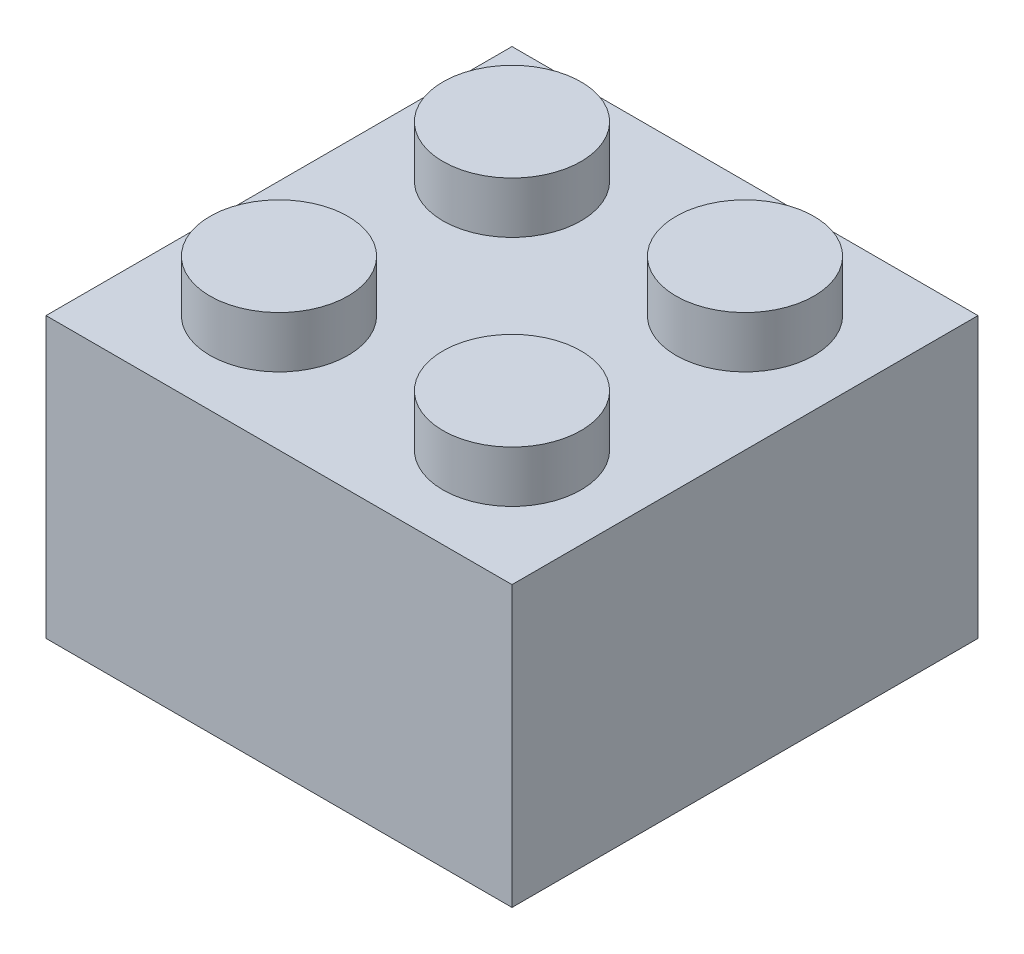
ISO-10303-21;
HEADER;
FILE_DESCRIPTION(('STEP AP214'),'2;1');
FILE_NAME('part.step','',(''),(''),'','','');
FILE_SCHEMA(('AUTOMOTIVE_DESIGN { 1 0 10303 214 1 1 1 1 }'));
ENDSEC;
DATA;
#1=APPLICATION_CONTEXT('core data for automotive mechanical design processes');
#2=APPLICATION_PROTOCOL_DEFINITION('international standard','automotive_design',2000,#1);
#3=PRODUCT_CONTEXT('',#1,'mechanical');
#4=PRODUCT('Part','Part','',(#3));
#5=PRODUCT_RELATED_PRODUCT_CATEGORY('part','',(#4));
#6=PRODUCT_DEFINITION_FORMATION('','',#4);
#7=PRODUCT_DEFINITION_CONTEXT('part definition',#1,'design');
#8=PRODUCT_DEFINITION('design','',#6,#7);
#9=PRODUCT_DEFINITION_SHAPE('','',#8);
#10=(LENGTH_UNIT() NAMED_UNIT(*) SI_UNIT(.MILLI.,.METRE.));
#11=(NAMED_UNIT(*) PLANE_ANGLE_UNIT() SI_UNIT($,.RADIAN.));
#12=(NAMED_UNIT(*) SI_UNIT($,.STERADIAN.) SOLID_ANGLE_UNIT());
#13=UNCERTAINTY_MEASURE_WITH_UNIT(LENGTH_MEASURE(1.E-05),#10,'distance_accuracy_value','');
#14=(GEOMETRIC_REPRESENTATION_CONTEXT(3) GLOBAL_UNCERTAINTY_ASSIGNED_CONTEXT((#13)) GLOBAL_UNIT_ASSIGNED_CONTEXT((#10,
#11,#12)) REPRESENTATION_CONTEXT('',''));
#15=CARTESIAN_POINT('',(0.,0.,0.));
#16=DIRECTION('',(0.,0.,1.));
#17=DIRECTION('',(1.,0.,0.));
#18=AXIS2_PLACEMENT_3D('',#15,#16,#17);
#19=CARTESIAN_POINT('',(0.,8.0355,0.));
#20=DIRECTION('',(0.,1.,0.));
#21=DIRECTION('',(0.,0.,1.));
#22=AXIS2_PLACEMENT_3D('',#19,#20,#21);
#23=PLANE('',#22);
#24=CARTESIAN_POINT('',(8.065,8.0355,-8.065));
#25=DIRECTION('',(0.,-1.,0.));
#26=DIRECTION('',(0.,0.,-1.));
#27=AXIS2_PLACEMENT_3D('',#24,#25,#26);
#28=CIRCLE('',#27,2.39);
#29=CARTESIAN_POINT('',(8.065,8.0355,-10.455));
#30=VERTEX_POINT('',#29);
#31=EDGE_CURVE('E19',#30,#30,#28,.T.);
#32=ORIENTED_EDGE('',*,*,#31,.T.);
#33=EDGE_LOOP('',(#32));
#34=FACE_BOUND('',#33,.T.);
#35=ADVANCED_FACE('F16',(#34),#23,.F.);
#36=CARTESIAN_POINT('',(8.065,8.0355,-8.065));
#37=DIRECTION('',(0.,-1.,0.));
#38=DIRECTION('',(0.,0.,-1.));
#39=AXIS2_PLACEMENT_3D('',#36,#37,#38);
#40=CYLINDRICAL_SURFACE('',#39,2.39);
#41=CARTESIAN_POINT('',(8.065,0.,-8.065));
#42=DIRECTION('',(0.,-1.,0.));
#43=DIRECTION('',(0.,0.,-1.));
#44=AXIS2_PLACEMENT_3D('',#41,#42,#43);
#45=CIRCLE('',#44,2.39);
#46=CARTESIAN_POINT('',(8.065,0.,-10.455));
#47=VERTEX_POINT('',#46);
#48=EDGE_CURVE('E134',#47,#47,#45,.T.);
#49=ORIENTED_EDGE('',*,*,#48,.T.);
#50=EDGE_LOOP('',(#49));
#51=FACE_BOUND('',#50,.T.);
#52=ORIENTED_EDGE('',*,*,#31,.F.);
#53=EDGE_LOOP('',(#52));
#54=FACE_BOUND('',#53,.T.);
#55=ADVANCED_FACE('F142',(#51,#54),#40,.F.);
#56=CARTESIAN_POINT('',(0.,0.,0.));
#57=DIRECTION('',(0.,1.,0.));
#58=DIRECTION('',(0.,0.,1.));
#59=AXIS2_PLACEMENT_3D('',#56,#57,#58);
#60=PLANE('',#59);
#61=ORIENTED_EDGE('',*,*,#48,.F.);
#62=EDGE_LOOP('',(#61));
#63=FACE_BOUND('',#62,.T.);
#64=CARTESIAN_POINT('',(8.065,0.,-8.065));
#65=DIRECTION('',(0.,-1.,0.));
#66=DIRECTION('',(0.,0.,-1.));
#67=AXIS2_PLACEMENT_3D('',#64,#65,#66);
#68=CIRCLE('',#67,3.31281619026951);
#69=CARTESIAN_POINT('',(8.065,0.,-11.3778161902695));
#70=VERTEX_POINT('',#69);
#71=EDGE_CURVE('E132',#70,#70,#68,.F.);
#72=ORIENTED_EDGE('',*,*,#71,.F.);
#73=EDGE_LOOP('',(#72));
#74=FACE_BOUND('',#73,.T.);
#75=ADVANCED_FACE('F144',(#63,#74),#60,.F.);
#76=CARTESIAN_POINT('',(8.065,8.0355,-8.065));
#77=DIRECTION('',(0.,-1.,0.));
#78=DIRECTION('',(0.,0.,-1.));
#79=AXIS2_PLACEMENT_3D('',#76,#77,#78);
#80=CYLINDRICAL_SURFACE('',#79,3.31281619026951);
#81=ORIENTED_EDGE('',*,*,#71,.T.);
#82=EDGE_LOOP('',(#81));
#83=FACE_BOUND('',#82,.T.);
#84=CARTESIAN_POINT('',(8.065,8.0355,-8.065));
#85=DIRECTION('',(0.,-1.,0.));
#86=DIRECTION('',(0.,0.,-1.));
#87=AXIS2_PLACEMENT_3D('',#84,#85,#86);
#88=CIRCLE('',#87,3.31281619026951);
#89=CARTESIAN_POINT('',(8.065,8.0355,-11.3778161902695));
#90=VERTEX_POINT('',#89);
#91=EDGE_CURVE('E89',#90,#90,#88,.T.);
#92=ORIENTED_EDGE('',*,*,#91,.T.);
#93=EDGE_LOOP('',(#92));
#94=FACE_BOUND('',#93,.T.);
#95=ADVANCED_FACE('F150',(#83,#94),#80,.T.);
#96=CARTESIAN_POINT('',(0.,8.0355,0.));
#97=DIRECTION('',(0.,1.,0.));
#98=DIRECTION('',(0.,0.,1.));
#99=AXIS2_PLACEMENT_3D('',#96,#97,#98);
#100=PLANE('',#99);
#101=ORIENTED_EDGE('',*,*,#91,.F.);
#102=EDGE_LOOP('',(#101));
#103=FACE_BOUND('',#102,.T.);
#104=DIRECTION('',(-1.,0.,0.));
#105=VECTOR('',#104,1.);
#106=CARTESIAN_POINT('',(16.13,8.0355,-14.4875));
#107=LINE('',#106,#105);
#108=CARTESIAN_POINT('',(1.6425,8.0355,-14.4875));
#109=VERTEX_POINT('',#108);
#110=CARTESIAN_POINT('',(14.4875,8.0355,-14.4875));
#111=VERTEX_POINT('',#110);
#112=EDGE_CURVE('E103',#109,#111,#107,.F.);
#113=ORIENTED_EDGE('',*,*,#112,.T.);
#114=DIRECTION('',(0.,0.,-1.));
#115=VECTOR('',#114,1.);
#116=CARTESIAN_POINT('',(14.4875,8.0355,0.));
#117=LINE('',#116,#115);
#118=CARTESIAN_POINT('',(14.4875,8.0355,-1.6425));
#119=VERTEX_POINT('',#118);
#120=EDGE_CURVE('E85',#111,#119,#117,.F.);
#121=ORIENTED_EDGE('',*,*,#120,.T.);
#122=DIRECTION('',(1.,0.,0.));
#123=VECTOR('',#122,1.);
#124=CARTESIAN_POINT('',(0.,8.0355,-1.6425));
#125=LINE('',#124,#123);
#126=CARTESIAN_POINT('',(1.6425,8.0355,-1.6425));
#127=VERTEX_POINT('',#126);
#128=EDGE_CURVE('E81',#119,#127,#125,.F.);
#129=ORIENTED_EDGE('',*,*,#128,.T.);
#130=DIRECTION('',(0.,0.,1.));
#131=VECTOR('',#130,1.);
#132=CARTESIAN_POINT('',(1.6425,8.0355,-16.13));
#133=LINE('',#132,#131);
#134=EDGE_CURVE('E78',#127,#109,#133,.F.);
#135=ORIENTED_EDGE('',*,*,#134,.T.);
#136=EDGE_LOOP('',(#113,#121,#129,#135));
#137=FACE_BOUND('',#136,.T.);
#138=ADVANCED_FACE('F83',(#103,#137),#100,.F.);
#139=CARTESIAN_POINT('',(0.,0.,-1.6425));
#140=DIRECTION('',(0.,0.,1.));
#141=DIRECTION('',(1.,0.,0.));
#142=AXIS2_PLACEMENT_3D('',#139,#140,#141);
#143=PLANE('',#142);
#144=ORIENTED_EDGE('',*,*,#128,.F.);
#145=DIRECTION('',(0.,1.,0.));
#146=VECTOR('',#145,1.);
#147=CARTESIAN_POINT('',(14.4875,0.,-1.6425));
#148=LINE('',#147,#146);
#149=CARTESIAN_POINT('',(14.4875,0.,-1.6425));
#150=VERTEX_POINT('',#149);
#151=EDGE_CURVE('E413',#119,#150,#148,.F.);
#152=ORIENTED_EDGE('',*,*,#151,.T.);
#153=DIRECTION('',(1.,0.,0.));
#154=VECTOR('',#153,1.);
#155=CARTESIAN_POINT('',(0.,0.,-1.6425));
#156=LINE('',#155,#154);
#157=CARTESIAN_POINT('',(1.6425,0.,-1.6425));
#158=VERTEX_POINT('',#157);
#159=EDGE_CURVE('E94',#150,#158,#156,.F.);
#160=ORIENTED_EDGE('',*,*,#159,.T.);
#161=DIRECTION('',(0.,1.,0.));
#162=VECTOR('',#161,1.);
#163=CARTESIAN_POINT('',(1.6425,0.,-1.6425));
#164=LINE('',#163,#162);
#165=EDGE_CURVE('E88',#158,#127,#164,.T.);
#166=ORIENTED_EDGE('',*,*,#165,.T.);
#167=EDGE_LOOP('',(#144,#152,#160,#166));
#168=FACE_BOUND('',#167,.T.);
#169=ADVANCED_FACE('F92',(#168),#143,.F.);
#170=CARTESIAN_POINT('',(1.6425,0.,-16.13));
#171=DIRECTION('',(-1.,0.,0.));
#172=DIRECTION('',(0.,0.,1.));
#173=AXIS2_PLACEMENT_3D('',#170,#171,#172);
#174=PLANE('',#173);
#175=ORIENTED_EDGE('',*,*,#134,.F.);
#176=ORIENTED_EDGE('',*,*,#165,.F.);
#177=DIRECTION('',(0.,0.,1.));
#178=VECTOR('',#177,1.);
#179=CARTESIAN_POINT('',(1.6425,0.,0.));
#180=LINE('',#179,#178);
#181=CARTESIAN_POINT('',(1.6425,0.,-14.4875));
#182=VERTEX_POINT('',#181);
#183=EDGE_CURVE('E416',#158,#182,#180,.F.);
#184=ORIENTED_EDGE('',*,*,#183,.T.);
#185=DIRECTION('',(0.,1.,0.));
#186=VECTOR('',#185,1.);
#187=CARTESIAN_POINT('',(1.6425,0.,-14.4875));
#188=LINE('',#187,#186);
#189=EDGE_CURVE('E100',#182,#109,#188,.T.);
#190=ORIENTED_EDGE('',*,*,#189,.T.);
#191=EDGE_LOOP('',(#175,#176,#184,#190));
#192=FACE_BOUND('',#191,.T.);
#193=ADVANCED_FACE('F98',(#192),#174,.F.);
#194=CARTESIAN_POINT('',(16.13,0.,-14.4875));
#195=DIRECTION('',(0.,0.,-1.));
#196=DIRECTION('',(-1.,0.,0.));
#197=AXIS2_PLACEMENT_3D('',#194,#195,#196);
#198=PLANE('',#197);
#199=ORIENTED_EDGE('',*,*,#112,.F.);
#200=ORIENTED_EDGE('',*,*,#189,.F.);
#201=DIRECTION('',(1.,0.,0.));
#202=VECTOR('',#201,1.);
#203=CARTESIAN_POINT('',(0.,0.,-14.4875));
#204=LINE('',#203,#202);
#205=CARTESIAN_POINT('',(14.4875,0.,-14.4875));
#206=VERTEX_POINT('',#205);
#207=EDGE_CURVE('E418',#182,#206,#204,.T.);
#208=ORIENTED_EDGE('',*,*,#207,.T.);
#209=DIRECTION('',(0.,1.,0.));
#210=VECTOR('',#209,1.);
#211=CARTESIAN_POINT('',(14.4875,0.,-14.4875));
#212=LINE('',#211,#210);
#213=EDGE_CURVE('E409',#206,#111,#212,.T.);
#214=ORIENTED_EDGE('',*,*,#213,.T.);
#215=EDGE_LOOP('',(#199,#200,#208,#214));
#216=FACE_BOUND('',#215,.T.);
#217=ADVANCED_FACE('F215',(#216),#198,.F.);
#218=CARTESIAN_POINT('',(14.4875,0.,0.));
#219=DIRECTION('',(1.,0.,0.));
#220=DIRECTION('',(0.,0.,-1.));
#221=AXIS2_PLACEMENT_3D('',#218,#219,#220);
#222=PLANE('',#221);
#223=ORIENTED_EDGE('',*,*,#120,.F.);
#224=ORIENTED_EDGE('',*,*,#213,.F.);
#225=DIRECTION('',(0.,0.,1.));
#226=VECTOR('',#225,1.);
#227=CARTESIAN_POINT('',(14.4875,0.,0.));
#228=LINE('',#227,#226);
#229=EDGE_CURVE('E420',#206,#150,#228,.T.);
#230=ORIENTED_EDGE('',*,*,#229,.T.);
#231=ORIENTED_EDGE('',*,*,#151,.F.);
#232=EDGE_LOOP('',(#223,#224,#230,#231));
#233=FACE_BOUND('',#232,.T.);
#234=ADVANCED_FACE('F211',(#233),#222,.F.);
#235=CARTESIAN_POINT('',(0.,0.,0.));
#236=DIRECTION('',(0.,1.,0.));
#237=DIRECTION('',(0.,0.,1.));
#238=AXIS2_PLACEMENT_3D('',#235,#236,#237);
#239=PLANE('',#238);
#240=ORIENTED_EDGE('',*,*,#207,.F.);
#241=ORIENTED_EDGE('',*,*,#183,.F.);
#242=ORIENTED_EDGE('',*,*,#159,.F.);
#243=ORIENTED_EDGE('',*,*,#229,.F.);
#244=EDGE_LOOP('',(#240,#241,#242,#243));
#245=FACE_BOUND('',#244,.T.);
#246=DIRECTION('',(-1.,0.,0.));
#247=VECTOR('',#246,1.);
#248=CARTESIAN_POINT('',(16.13,0.,-16.13));
#249=LINE('',#248,#247);
#250=CARTESIAN_POINT('',(16.13,0.,-16.13));
#251=VERTEX_POINT('',#250);
#252=CARTESIAN_POINT('',(0.,0.,-16.13));
#253=VERTEX_POINT('',#252);
#254=EDGE_CURVE('E428',#251,#253,#249,.T.);
#255=ORIENTED_EDGE('',*,*,#254,.F.);
#256=DIRECTION('',(0.,0.,-1.));
#257=VECTOR('',#256,1.);
#258=CARTESIAN_POINT('',(16.13,0.,0.));
#259=LINE('',#258,#257);
#260=CARTESIAN_POINT('',(16.13,0.,0.));
#261=VERTEX_POINT('',#260);
#262=EDGE_CURVE('E423',#261,#251,#259,.T.);
#263=ORIENTED_EDGE('',*,*,#262,.F.);
#264=DIRECTION('',(1.,0.,0.));
#265=VECTOR('',#264,1.);
#266=CARTESIAN_POINT('',(0.,0.,0.));
#267=LINE('',#266,#265);
#268=CARTESIAN_POINT('',(0.,0.,0.));
#269=VERTEX_POINT('',#268);
#270=EDGE_CURVE('E129',#269,#261,#267,.T.);
#271=ORIENTED_EDGE('',*,*,#270,.F.);
#272=DIRECTION('',(0.,0.,1.));
#273=VECTOR('',#272,1.);
#274=CARTESIAN_POINT('',(0.,0.,-16.13));
#275=LINE('',#274,#273);
#276=EDGE_CURVE('E433',#253,#269,#275,.T.);
#277=ORIENTED_EDGE('',*,*,#276,.F.);
#278=EDGE_LOOP('',(#255,#263,#271,#277));
#279=FACE_BOUND('',#278,.T.);
#280=ADVANCED_FACE('F207',(#245,#279),#239,.F.);
#281=CARTESIAN_POINT('',(0.,11.458,0.));
#282=DIRECTION('',(0.,1.,0.));
#283=DIRECTION('',(0.,0.,1.));
#284=AXIS2_PLACEMENT_3D('',#281,#282,#283);
#285=PLANE('',#284);
#286=CARTESIAN_POINT('',(12.0975,11.458,-4.0325));
#287=DIRECTION('',(0.,1.,0.));
#288=DIRECTION('',(0.,0.,1.));
#289=AXIS2_PLACEMENT_3D('',#286,#287,#288);
#290=CIRCLE('',#289,2.39);
#291=CARTESIAN_POINT('',(12.0975,11.458,-1.6425));
#292=VERTEX_POINT('',#291);
#293=EDGE_CURVE('E126',#292,#292,#290,.F.);
#294=ORIENTED_EDGE('',*,*,#293,.F.);
#295=EDGE_LOOP('',(#294));
#296=FACE_BOUND('',#295,.T.);
#297=ADVANCED_FACE('F203',(#296),#285,.T.);
#298=CARTESIAN_POINT('',(0.,11.458,-8.065));
#299=DIRECTION('',(0.,1.,0.));
#300=DIRECTION('',(0.,0.,1.));
#301=AXIS2_PLACEMENT_3D('',#298,#299,#300);
#302=PLANE('',#301);
#303=CARTESIAN_POINT('',(12.0975,11.458,-12.0975));
#304=DIRECTION('',(0.,1.,0.));
#305=DIRECTION('',(0.,0.,1.));
#306=AXIS2_PLACEMENT_3D('',#303,#304,#305);
#307=CIRCLE('',#306,2.39);
#308=CARTESIAN_POINT('',(12.0975,11.458,-9.7075));
#309=VERTEX_POINT('',#308);
#310=EDGE_CURVE('E123',#309,#309,#307,.F.);
#311=ORIENTED_EDGE('',*,*,#310,.F.);
#312=EDGE_LOOP('',(#311));
#313=FACE_BOUND('',#312,.T.);
#314=ADVANCED_FACE('F199',(#313),#302,.T.);
#315=CARTESIAN_POINT('',(-8.065,11.458,0.));
#316=DIRECTION('',(0.,1.,0.));
#317=DIRECTION('',(0.,0.,1.));
#318=AXIS2_PLACEMENT_3D('',#315,#316,#317);
#319=PLANE('',#318);
#320=CARTESIAN_POINT('',(4.0325,11.458,-4.0325));
#321=DIRECTION('',(0.,1.,0.));
#322=DIRECTION('',(0.,0.,1.));
#323=AXIS2_PLACEMENT_3D('',#320,#321,#322);
#324=CIRCLE('',#323,2.39);
#325=CARTESIAN_POINT('',(4.0325,11.458,-1.6425));
#326=VERTEX_POINT('',#325);
#327=EDGE_CURVE('E120',#326,#326,#324,.F.);
#328=ORIENTED_EDGE('',*,*,#327,.F.);
#329=EDGE_LOOP('',(#328));
#330=FACE_BOUND('',#329,.T.);
#331=ADVANCED_FACE('F195',(#330),#319,.T.);
#332=CARTESIAN_POINT('',(-8.065,11.458,-8.065));
#333=DIRECTION('',(0.,1.,0.));
#334=DIRECTION('',(0.,0.,1.));
#335=AXIS2_PLACEMENT_3D('',#332,#333,#334);
#336=PLANE('',#335);
#337=CARTESIAN_POINT('',(4.0325,11.458,-12.0975));
#338=DIRECTION('',(0.,1.,0.));
#339=DIRECTION('',(0.,0.,1.));
#340=AXIS2_PLACEMENT_3D('',#337,#338,#339);
#341=CIRCLE('',#340,2.39);
#342=CARTESIAN_POINT('',(4.0325,11.458,-9.7075));
#343=VERTEX_POINT('',#342);
#344=EDGE_CURVE('E116',#343,#343,#341,.F.);
#345=ORIENTED_EDGE('',*,*,#344,.F.);
#346=EDGE_LOOP('',(#345));
#347=FACE_BOUND('',#346,.T.);
#348=ADVANCED_FACE('F191',(#347),#336,.T.);
#349=CARTESIAN_POINT('',(16.13,0.,0.));
#350=DIRECTION('',(1.,0.,0.));
#351=DIRECTION('',(0.,0.,-1.));
#352=AXIS2_PLACEMENT_3D('',#349,#350,#351);
#353=PLANE('',#352);
#354=DIRECTION('',(0.,1.,0.));
#355=VECTOR('',#354,1.);
#356=CARTESIAN_POINT('',(16.13,0.,0.));
#357=LINE('',#356,#355);
#358=CARTESIAN_POINT('',(16.13,9.678,0.));
#359=VERTEX_POINT('',#358);
#360=EDGE_CURVE('E435',#261,#359,#357,.T.);
#361=ORIENTED_EDGE('',*,*,#360,.F.);
#362=ORIENTED_EDGE('',*,*,#262,.T.);
#363=DIRECTION('',(0.,1.,0.));
#364=VECTOR('',#363,1.);
#365=CARTESIAN_POINT('',(16.13,0.,-16.13));
#366=LINE('',#365,#364);
#367=CARTESIAN_POINT('',(16.13,9.678,-16.13));
#368=VERTEX_POINT('',#367);
#369=EDGE_CURVE('E425',#368,#251,#366,.F.);
#370=ORIENTED_EDGE('',*,*,#369,.F.);
#371=DIRECTION('',(0.,0.,1.));
#372=VECTOR('',#371,1.);
#373=CARTESIAN_POINT('',(16.13,9.678,0.));
#374=LINE('',#373,#372);
#375=EDGE_CURVE('E119',#359,#368,#374,.F.);
#376=ORIENTED_EDGE('',*,*,#375,.F.);
#377=EDGE_LOOP('',(#361,#362,#370,#376));
#378=FACE_BOUND('',#377,.T.);
#379=ADVANCED_FACE('F187',(#378),#353,.T.);
#380=CARTESIAN_POINT('',(16.13,0.,-16.13));
#381=DIRECTION('',(0.,0.,-1.));
#382=DIRECTION('',(-1.,0.,0.));
#383=AXIS2_PLACEMENT_3D('',#380,#381,#382);
#384=PLANE('',#383);
#385=ORIENTED_EDGE('',*,*,#369,.T.);
#386=ORIENTED_EDGE('',*,*,#254,.T.);
#387=DIRECTION('',(0.,1.,0.));
#388=VECTOR('',#387,1.);
#389=CARTESIAN_POINT('',(0.,0.,-16.13));
#390=LINE('',#389,#388);
#391=CARTESIAN_POINT('',(0.,9.678,-16.13));
#392=VERTEX_POINT('',#391);
#393=EDGE_CURVE('E430',#392,#253,#390,.F.);
#394=ORIENTED_EDGE('',*,*,#393,.F.);
#395=DIRECTION('',(1.,0.,0.));
#396=VECTOR('',#395,1.);
#397=CARTESIAN_POINT('',(0.,9.678,-16.13));
#398=LINE('',#397,#396);
#399=EDGE_CURVE('E443',#368,#392,#398,.F.);
#400=ORIENTED_EDGE('',*,*,#399,.F.);
#401=EDGE_LOOP('',(#385,#386,#394,#400));
#402=FACE_BOUND('',#401,.T.);
#403=ADVANCED_FACE('F184',(#402),#384,.T.);
#404=CARTESIAN_POINT('',(0.,0.,-16.13));
#405=DIRECTION('',(-1.,0.,0.));
#406=DIRECTION('',(0.,0.,1.));
#407=AXIS2_PLACEMENT_3D('',#404,#405,#406);
#408=PLANE('',#407);
#409=ORIENTED_EDGE('',*,*,#393,.T.);
#410=ORIENTED_EDGE('',*,*,#276,.T.);
#411=DIRECTION('',(0.,1.,0.));
#412=VECTOR('',#411,1.);
#413=CARTESIAN_POINT('',(0.,0.,0.));
#414=LINE('',#413,#412);
#415=CARTESIAN_POINT('',(0.,9.678,0.));
#416=VERTEX_POINT('',#415);
#417=EDGE_CURVE('E34',#416,#269,#414,.F.);
#418=ORIENTED_EDGE('',*,*,#417,.F.);
#419=DIRECTION('',(0.,0.,1.));
#420=VECTOR('',#419,1.);
#421=CARTESIAN_POINT('',(0.,9.678,0.));
#422=LINE('',#421,#420);
#423=EDGE_CURVE('E446',#392,#416,#422,.T.);
#424=ORIENTED_EDGE('',*,*,#423,.F.);
#425=EDGE_LOOP('',(#409,#410,#418,#424));
#426=FACE_BOUND('',#425,.T.);
#427=ADVANCED_FACE('F180',(#426),#408,.T.);
#428=CARTESIAN_POINT('',(0.,0.,0.));
#429=DIRECTION('',(0.,0.,1.));
#430=DIRECTION('',(1.,0.,0.));
#431=AXIS2_PLACEMENT_3D('',#428,#429,#430);
#432=PLANE('',#431);
#433=ORIENTED_EDGE('',*,*,#417,.T.);
#434=ORIENTED_EDGE('',*,*,#270,.T.);
#435=ORIENTED_EDGE('',*,*,#360,.T.);
#436=DIRECTION('',(1.,0.,0.));
#437=VECTOR('',#436,1.);
#438=CARTESIAN_POINT('',(0.,9.678,0.));
#439=LINE('',#438,#437);
#440=EDGE_CURVE('E115',#416,#359,#439,.T.);
#441=ORIENTED_EDGE('',*,*,#440,.F.);
#442=EDGE_LOOP('',(#433,#434,#435,#441));
#443=FACE_BOUND('',#442,.T.);
#444=ADVANCED_FACE('F176',(#443),#432,.T.);
#445=CARTESIAN_POINT('',(12.0975,9.678,-4.0325));
#446=DIRECTION('',(0.,1.,0.));
#447=DIRECTION('',(0.,0.,1.));
#448=AXIS2_PLACEMENT_3D('',#445,#446,#447);
#449=CYLINDRICAL_SURFACE('',#448,2.39);
#450=ORIENTED_EDGE('',*,*,#293,.T.);
#451=EDGE_LOOP('',(#450));
#452=FACE_BOUND('',#451,.T.);
#453=CARTESIAN_POINT('',(12.0975,9.678,-4.0325));
#454=DIRECTION('',(0.,1.,0.));
#455=DIRECTION('',(0.,0.,1.));
#456=AXIS2_PLACEMENT_3D('',#453,#454,#455);
#457=CIRCLE('',#456,2.39);
#458=CARTESIAN_POINT('',(12.0975,9.678,-1.6425));
#459=VERTEX_POINT('',#458);
#460=EDGE_CURVE('E112',#459,#459,#457,.F.);
#461=ORIENTED_EDGE('',*,*,#460,.F.);
#462=EDGE_LOOP('',(#461));
#463=FACE_BOUND('',#462,.T.);
#464=ADVANCED_FACE('F172',(#452,#463),#449,.T.);
#465=CARTESIAN_POINT('',(12.0975,9.678,-12.0975));
#466=DIRECTION('',(0.,1.,0.));
#467=DIRECTION('',(0.,0.,1.));
#468=AXIS2_PLACEMENT_3D('',#465,#466,#467);
#469=CYLINDRICAL_SURFACE('',#468,2.39);
#470=ORIENTED_EDGE('',*,*,#310,.T.);
#471=EDGE_LOOP('',(#470));
#472=FACE_BOUND('',#471,.T.);
#473=CARTESIAN_POINT('',(12.0975,9.678,-12.0975));
#474=DIRECTION('',(0.,1.,0.));
#475=DIRECTION('',(0.,0.,1.));
#476=AXIS2_PLACEMENT_3D('',#473,#474,#475);
#477=CIRCLE('',#476,2.39);
#478=CARTESIAN_POINT('',(12.0975,9.678,-9.7075));
#479=VERTEX_POINT('',#478);
#480=EDGE_CURVE('E109',#479,#479,#477,.F.);
#481=ORIENTED_EDGE('',*,*,#480,.F.);
#482=EDGE_LOOP('',(#481));
#483=FACE_BOUND('',#482,.T.);
#484=ADVANCED_FACE('F168',(#472,#483),#469,.T.);
#485=CARTESIAN_POINT('',(4.0325,9.678,-4.0325));
#486=DIRECTION('',(0.,1.,0.));
#487=DIRECTION('',(0.,0.,1.));
#488=AXIS2_PLACEMENT_3D('',#485,#486,#487);
#489=CYLINDRICAL_SURFACE('',#488,2.39);
#490=ORIENTED_EDGE('',*,*,#327,.T.);
#491=EDGE_LOOP('',(#490));
#492=FACE_BOUND('',#491,.T.);
#493=CARTESIAN_POINT('',(4.0325,9.678,-4.0325));
#494=DIRECTION('',(0.,1.,0.));
#495=DIRECTION('',(0.,0.,1.));
#496=AXIS2_PLACEMENT_3D('',#493,#494,#495);
#497=CIRCLE('',#496,2.39);
#498=CARTESIAN_POINT('',(4.0325,9.678,-1.6425));
#499=VERTEX_POINT('',#498);
#500=EDGE_CURVE('E25',#499,#499,#497,.F.);
#501=ORIENTED_EDGE('',*,*,#500,.F.);
#502=EDGE_LOOP('',(#501));
#503=FACE_BOUND('',#502,.T.);
#504=ADVANCED_FACE('F161',(#492,#503),#489,.T.);
#505=CARTESIAN_POINT('',(4.0325,9.678,-12.0975));
#506=DIRECTION('',(0.,1.,0.));
#507=DIRECTION('',(0.,0.,1.));
#508=AXIS2_PLACEMENT_3D('',#505,#506,#507);
#509=CYLINDRICAL_SURFACE('',#508,2.39);
#510=ORIENTED_EDGE('',*,*,#344,.T.);
#511=EDGE_LOOP('',(#510));
#512=FACE_BOUND('',#511,.T.);
#513=CARTESIAN_POINT('',(4.0325,9.678,-12.0975));
#514=DIRECTION('',(0.,1.,0.));
#515=DIRECTION('',(0.,0.,1.));
#516=AXIS2_PLACEMENT_3D('',#513,#514,#515);
#517=CIRCLE('',#516,2.39);
#518=CARTESIAN_POINT('',(4.0325,9.678,-9.7075));
#519=VERTEX_POINT('',#518);
#520=EDGE_CURVE('E10',#519,#519,#517,.F.);
#521=ORIENTED_EDGE('',*,*,#520,.F.);
#522=EDGE_LOOP('',(#521));
#523=FACE_BOUND('',#522,.T.);
#524=ADVANCED_FACE('F155',(#512,#523),#509,.T.);
#525=CARTESIAN_POINT('',(0.,9.678,0.));
#526=DIRECTION('',(0.,1.,0.));
#527=DIRECTION('',(0.,0.,1.));
#528=AXIS2_PLACEMENT_3D('',#525,#526,#527);
#529=PLANE('',#528);
#530=ORIENTED_EDGE('',*,*,#520,.T.);
#531=EDGE_LOOP('',(#530));
#532=FACE_BOUND('',#531,.T.);
#533=ORIENTED_EDGE('',*,*,#500,.T.);
#534=EDGE_LOOP('',(#533));
#535=FACE_BOUND('',#534,.T.);
#536=ORIENTED_EDGE('',*,*,#480,.T.);
#537=EDGE_LOOP('',(#536));
#538=FACE_BOUND('',#537,.T.);
#539=ORIENTED_EDGE('',*,*,#460,.T.);
#540=EDGE_LOOP('',(#539));
#541=FACE_BOUND('',#540,.T.);
#542=ORIENTED_EDGE('',*,*,#423,.T.);
#543=ORIENTED_EDGE('',*,*,#440,.T.);
#544=ORIENTED_EDGE('',*,*,#375,.T.);
#545=ORIENTED_EDGE('',*,*,#399,.T.);
#546=EDGE_LOOP('',(#542,#543,#544,#545));
#547=FACE_BOUND('',#546,.T.);
#548=ADVANCED_FACE('F153',(#532,#535,#538,#541,#547),#529,.T.);
#549=CLOSED_SHELL('',(#35,#55,#75,#95,#138,#169,#193,#217,#234,#280,#297,#314,#331,#348,#379,
#403,#427,#444,#464,#484,#504,#524,#548));
#550=MANIFOLD_SOLID_BREP('B1',#549);
#551=ADVANCED_BREP_SHAPE_REPRESENTATION('',(#18,#550),#14);
#552=SHAPE_DEFINITION_REPRESENTATION(#9,#551);
ENDSEC;
END-ISO-10303-21;
